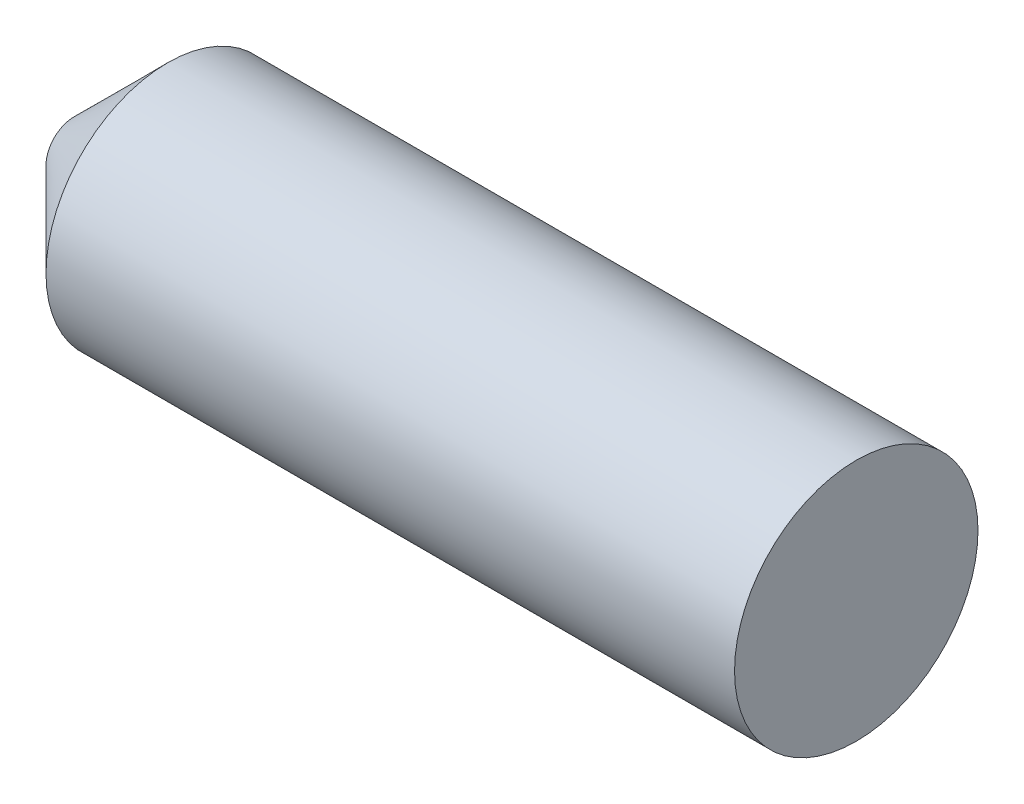
ISO-10303-21;
HEADER;
FILE_DESCRIPTION(('STEP AP214'),'2;1');
FILE_NAME('part.step','',(''),(''),'','','');
FILE_SCHEMA(('AUTOMOTIVE_DESIGN { 1 0 10303 214 1 1 1 1 }'));
ENDSEC;
DATA;
#1=APPLICATION_CONTEXT('core data for automotive mechanical design processes');
#2=APPLICATION_PROTOCOL_DEFINITION('international standard','automotive_design',2000,#1);
#3=PRODUCT_CONTEXT('',#1,'mechanical');
#4=PRODUCT('Part','Part','',(#3));
#5=PRODUCT_RELATED_PRODUCT_CATEGORY('part','',(#4));
#6=PRODUCT_DEFINITION_FORMATION('','',#4);
#7=PRODUCT_DEFINITION_CONTEXT('part definition',#1,'design');
#8=PRODUCT_DEFINITION('design','',#6,#7);
#9=PRODUCT_DEFINITION_SHAPE('','',#8);
#10=(LENGTH_UNIT() NAMED_UNIT(*) SI_UNIT(.MILLI.,.METRE.));
#11=(NAMED_UNIT(*) PLANE_ANGLE_UNIT() SI_UNIT($,.RADIAN.));
#12=(NAMED_UNIT(*) SI_UNIT($,.STERADIAN.) SOLID_ANGLE_UNIT());
#13=UNCERTAINTY_MEASURE_WITH_UNIT(LENGTH_MEASURE(1.E-05),#10,'distance_accuracy_value','');
#14=(GEOMETRIC_REPRESENTATION_CONTEXT(3) GLOBAL_UNCERTAINTY_ASSIGNED_CONTEXT((#13)) GLOBAL_UNIT_ASSIGNED_CONTEXT((#10,
#11,#12)) REPRESENTATION_CONTEXT('',''));
#15=CARTESIAN_POINT('',(0.,0.,0.));
#16=DIRECTION('',(0.,0.,1.));
#17=DIRECTION('',(1.,0.,0.));
#18=AXIS2_PLACEMENT_3D('',#15,#16,#17);
#19=CARTESIAN_POINT('',(121.031,0.,0.));
#20=DIRECTION('',(-1.,0.,0.));
#21=DIRECTION('',(0.,0.,1.));
#22=AXIS2_PLACEMENT_3D('',#19,#20,#21);
#23=CYLINDRICAL_SURFACE('',#22,24.765);
#24=CARTESIAN_POINT('',(-19.0499999999999,0.,0.));
#25=DIRECTION('',(-1.,0.,0.));
#26=DIRECTION('',(0.,0.,1.));
#27=AXIS2_PLACEMENT_3D('',#24,#25,#26);
#28=CIRCLE('',#27,24.765);
#29=CARTESIAN_POINT('',(-19.0499999999999,0.,24.765));
#30=VERTEX_POINT('',#29);
#31=EDGE_CURVE('E10',#30,#30,#28,.F.);
#32=ORIENTED_EDGE('',*,*,#31,.T.);
#33=EDGE_LOOP('',(#32));
#34=FACE_BOUND('',#33,.T.);
#35=CARTESIAN_POINT('',(121.031,0.,0.));
#36=DIRECTION('',(1.,0.,0.));
#37=DIRECTION('',(0.,0.,-1.));
#38=AXIS2_PLACEMENT_3D('',#35,#36,#37);
#39=CIRCLE('',#38,24.765);
#40=CARTESIAN_POINT('',(121.031,0.,-24.765));
#41=VERTEX_POINT('',#40);
#42=EDGE_CURVE('E51',#41,#41,#39,.T.);
#43=ORIENTED_EDGE('',*,*,#42,.F.);
#44=EDGE_LOOP('',(#43));
#45=FACE_BOUND('',#44,.T.);
#46=ADVANCED_FACE('F39',(#34,#45),#23,.T.);
#47=CARTESIAN_POINT('',(121.031,0.,0.));
#48=DIRECTION('',(1.,0.,0.));
#49=DIRECTION('',(0.,0.,-1.));
#50=AXIS2_PLACEMENT_3D('',#47,#48,#49);
#51=PLANE('',#50);
#52=ORIENTED_EDGE('',*,*,#42,.T.);
#53=EDGE_LOOP('',(#52));
#54=FACE_BOUND('',#53,.T.);
#55=ADVANCED_FACE('F58',(#54),#51,.T.);
#56=CARTESIAN_POINT('',(-38.1,0.,0.));
#57=DIRECTION('',(-1.,0.,0.));
#58=DIRECTION('',(0.,0.,1.));
#59=AXIS2_PLACEMENT_3D('',#56,#57,#58);
#60=PLANE('',#59);
#61=CARTESIAN_POINT('',(-38.1,0.,0.));
#62=DIRECTION('',(-1.,0.,0.));
#63=DIRECTION('',(0.,0.,1.));
#64=AXIS2_PLACEMENT_3D('',#61,#62,#63);
#65=CIRCLE('',#64,5.71500000000001);
#66=CARTESIAN_POINT('',(-38.1,0.,5.71500000000001));
#67=VERTEX_POINT('',#66);
#68=EDGE_CURVE('E47',#67,#67,#65,.T.);
#69=ORIENTED_EDGE('',*,*,#68,.T.);
#70=EDGE_LOOP('',(#69));
#71=FACE_BOUND('',#70,.T.);
#72=ADVANCED_FACE('F64',(#71),#60,.T.);
#73=CARTESIAN_POINT('',(-38.1,0.,0.));
#74=DIRECTION('',(1.,0.,0.));
#75=DIRECTION('',(0.,0.,-1.));
#76=AXIS2_PLACEMENT_3D('',#73,#74,#75);
#77=CONICAL_SURFACE('',#76,5.715,0.785398163397447);
#78=ORIENTED_EDGE('',*,*,#31,.F.);
#79=EDGE_LOOP('',(#78));
#80=FACE_BOUND('',#79,.T.);
#81=ORIENTED_EDGE('',*,*,#68,.F.);
#82=EDGE_LOOP('',(#81));
#83=FACE_BOUND('',#82,.T.);
#84=ADVANCED_FACE('F42',(#80,#83),#77,.T.);
#85=CLOSED_SHELL('',(#46,#55,#72,#84));
#86=MANIFOLD_SOLID_BREP('B2',#85);
#87=ADVANCED_BREP_SHAPE_REPRESENTATION('',(#18,#86),#14);
#88=SHAPE_DEFINITION_REPRESENTATION(#9,#87);
ENDSEC;
END-ISO-10303-21;
